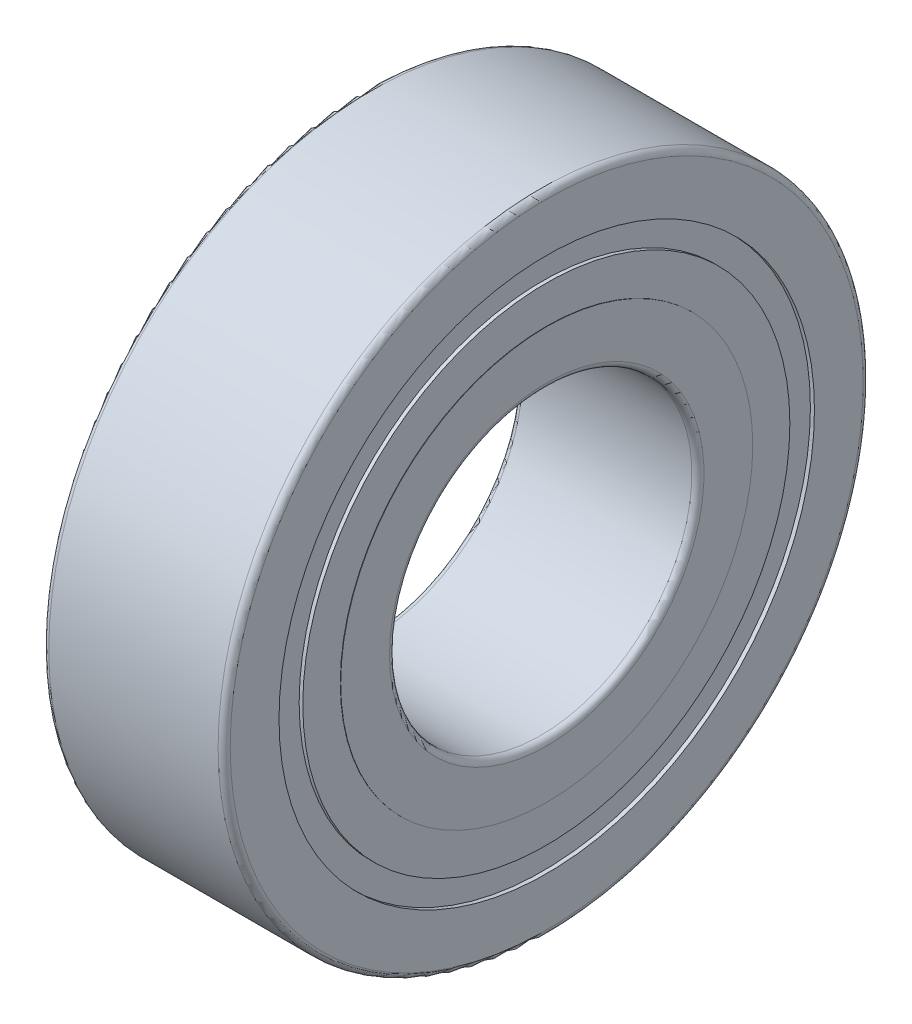
ISO-10303-21;
HEADER;
FILE_DESCRIPTION(('STEP AP214'),'2;1');
FILE_NAME('part.step','',(''),(''),'','','');
FILE_SCHEMA(('AUTOMOTIVE_DESIGN { 1 0 10303 214 1 1 1 1 }'));
ENDSEC;
DATA;
#1=APPLICATION_CONTEXT('core data for automotive mechanical design processes');
#2=APPLICATION_PROTOCOL_DEFINITION('international standard','automotive_design',2000,#1);
#3=PRODUCT_CONTEXT('',#1,'mechanical');
#4=PRODUCT('Part','Part','',(#3));
#5=PRODUCT_RELATED_PRODUCT_CATEGORY('part','',(#4));
#6=PRODUCT_DEFINITION_FORMATION('','',#4);
#7=PRODUCT_DEFINITION_CONTEXT('part definition',#1,'design');
#8=PRODUCT_DEFINITION('design','',#6,#7);
#9=PRODUCT_DEFINITION_SHAPE('','',#8);
#10=(LENGTH_UNIT() NAMED_UNIT(*) SI_UNIT(.MILLI.,.METRE.));
#11=(NAMED_UNIT(*) PLANE_ANGLE_UNIT() SI_UNIT($,.RADIAN.));
#12=(NAMED_UNIT(*) SI_UNIT($,.STERADIAN.) SOLID_ANGLE_UNIT());
#13=UNCERTAINTY_MEASURE_WITH_UNIT(LENGTH_MEASURE(1.E-05),#10,'distance_accuracy_value','');
#14=(GEOMETRIC_REPRESENTATION_CONTEXT(3) GLOBAL_UNCERTAINTY_ASSIGNED_CONTEXT((#13)) GLOBAL_UNIT_ASSIGNED_CONTEXT((#10,
#11,#12)) REPRESENTATION_CONTEXT('',''));
#15=CARTESIAN_POINT('',(0.,0.,0.));
#16=DIRECTION('',(0.,0.,1.));
#17=DIRECTION('',(1.,0.,0.));
#18=AXIS2_PLACEMENT_3D('',#15,#16,#17);
#19=CARTESIAN_POINT('',(4.5,7.8,0.));
#20=DIRECTION('',(-1.,0.,0.));
#21=DIRECTION('',(0.,0.,1.));
#22=AXIS2_PLACEMENT_3D('',#19,#20,#21);
#23=PLANE('',#22);
#24=CARTESIAN_POINT('',(4.5,0.,0.));
#25=DIRECTION('',(-1.,0.,0.));
#26=DIRECTION('',(0.,0.,1.));
#27=AXIS2_PLACEMENT_3D('',#24,#25,#26);
#28=CIRCLE('',#27,15.7);
#29=CARTESIAN_POINT('',(4.5,0.,15.7));
#30=VERTEX_POINT('',#29);
#31=EDGE_CURVE('E69',#30,#30,#28,.T.);
#32=ORIENTED_EDGE('',*,*,#31,.F.);
#33=EDGE_LOOP('',(#32));
#34=FACE_BOUND('',#33,.T.);
#35=CARTESIAN_POINT('',(4.5,0.,0.));
#36=DIRECTION('',(-1.,0.,0.));
#37=DIRECTION('',(0.,0.,1.));
#38=AXIS2_PLACEMENT_3D('',#35,#36,#37);
#39=CIRCLE('',#38,13.28);
#40=CARTESIAN_POINT('',(4.5,0.,13.28));
#41=VERTEX_POINT('',#40);
#42=EDGE_CURVE('E36',#41,#41,#39,.F.);
#43=ORIENTED_EDGE('',*,*,#42,.F.);
#44=EDGE_LOOP('',(#43));
#45=FACE_BOUND('',#44,.T.);
#46=ADVANCED_FACE('F32',(#34,#45),#23,.F.);
#47=CARTESIAN_POINT('',(4.5,0.,0.));
#48=DIRECTION('',(-1.,0.,0.));
#49=DIRECTION('',(0.,0.,1.));
#50=AXIS2_PLACEMENT_3D('',#47,#48,#49);
#51=CIRCLE('',#50,7.8);
#52=CARTESIAN_POINT('',(4.5,0.,7.8));
#53=VERTEX_POINT('',#52);
#54=EDGE_CURVE('E72',#53,#53,#51,.T.);
#55=ORIENTED_EDGE('',*,*,#54,.T.);
#56=EDGE_LOOP('',(#55));
#57=FACE_BOUND('',#56,.T.);
#58=CARTESIAN_POINT('',(4.5,0.,0.));
#59=DIRECTION('',(-1.,0.,0.));
#60=DIRECTION('',(0.,0.,1.));
#61=AXIS2_PLACEMENT_3D('',#58,#59,#60);
#62=CIRCLE('',#61,10.22);
#63=CARTESIAN_POINT('',(4.5,0.,10.22));
#64=VERTEX_POINT('',#63);
#65=EDGE_CURVE('E287',#64,#64,#62,.T.);
#66=ORIENTED_EDGE('',*,*,#65,.F.);
#67=EDGE_LOOP('',(#66));
#68=FACE_BOUND('',#67,.T.);
#69=ADVANCED_FACE('F91',(#57,#68),#23,.F.);
#70=CARTESIAN_POINT('',(-4.5,15.7,0.));
#71=DIRECTION('',(1.,0.,0.));
#72=DIRECTION('',(0.,0.,-1.));
#73=AXIS2_PLACEMENT_3D('',#70,#71,#72);
#74=PLANE('',#73);
#75=CARTESIAN_POINT('',(-4.5,0.,0.));
#76=DIRECTION('',(-1.,0.,0.));
#77=DIRECTION('',(0.,0.,1.));
#78=AXIS2_PLACEMENT_3D('',#75,#76,#77);
#79=CIRCLE('',#78,7.8);
#80=CARTESIAN_POINT('',(-4.5,0.,7.8));
#81=VERTEX_POINT('',#80);
#82=EDGE_CURVE('E40',#81,#81,#79,.T.);
#83=ORIENTED_EDGE('',*,*,#82,.F.);
#84=EDGE_LOOP('',(#83));
#85=FACE_BOUND('',#84,.T.);
#86=CARTESIAN_POINT('',(-4.5,0.,0.));
#87=DIRECTION('',(-1.,0.,0.));
#88=DIRECTION('',(0.,0.,1.));
#89=AXIS2_PLACEMENT_3D('',#86,#87,#88);
#90=CIRCLE('',#89,10.22);
#91=CARTESIAN_POINT('',(-4.5,0.,10.22));
#92=VERTEX_POINT('',#91);
#93=EDGE_CURVE('E51',#92,#92,#90,.T.);
#94=ORIENTED_EDGE('',*,*,#93,.T.);
#95=EDGE_LOOP('',(#94));
#96=FACE_BOUND('',#95,.T.);
#97=ADVANCED_FACE('F88',(#85,#96),#74,.F.);
#98=CARTESIAN_POINT('',(-4.5,0.,0.));
#99=DIRECTION('',(-1.,0.,0.));
#100=DIRECTION('',(0.,0.,1.));
#101=AXIS2_PLACEMENT_3D('',#98,#99,#100);
#102=CIRCLE('',#101,15.7);
#103=CARTESIAN_POINT('',(-4.5,0.,15.7));
#104=VERTEX_POINT('',#103);
#105=EDGE_CURVE('E10',#104,#104,#102,.T.);
#106=ORIENTED_EDGE('',*,*,#105,.T.);
#107=EDGE_LOOP('',(#106));
#108=FACE_BOUND('',#107,.T.);
#109=CARTESIAN_POINT('',(-4.5,0.,0.));
#110=DIRECTION('',(1.,0.,0.));
#111=DIRECTION('',(0.,0.,-1.));
#112=AXIS2_PLACEMENT_3D('',#109,#110,#111);
#113=CIRCLE('',#112,13.28);
#114=CARTESIAN_POINT('',(-4.5,0.,-13.28));
#115=VERTEX_POINT('',#114);
#116=EDGE_CURVE('E48',#115,#115,#113,.F.);
#117=ORIENTED_EDGE('',*,*,#116,.F.);
#118=EDGE_LOOP('',(#117));
#119=FACE_BOUND('',#118,.T.);
#120=ADVANCED_FACE('F90',(#108,#119),#74,.F.);
#121=CARTESIAN_POINT('',(-4.20000000000012,0.,0.));
#122=DIRECTION('',(-1.,0.,0.));
#123=DIRECTION('',(0.,0.,1.));
#124=AXIS2_PLACEMENT_3D('',#121,#122,#123);
#125=TOROIDAL_SURFACE('',#124,15.7000000000001,0.29999999999988);
#126=ORIENTED_EDGE('',*,*,#105,.F.);
#127=EDGE_LOOP('',(#126));
#128=FACE_BOUND('',#127,.T.);
#129=CARTESIAN_POINT('',(-4.2,0.,0.));
#130=DIRECTION('',(-1.,0.,0.));
#131=DIRECTION('',(0.,0.,1.));
#132=AXIS2_PLACEMENT_3D('',#129,#130,#131);
#133=CIRCLE('',#132,16.);
#134=CARTESIAN_POINT('',(-4.2,0.,16.));
#135=VERTEX_POINT('',#134);
#136=EDGE_CURVE('E50',#135,#135,#133,.T.);
#137=ORIENTED_EDGE('',*,*,#136,.T.);
#138=EDGE_LOOP('',(#137));
#139=FACE_BOUND('',#138,.T.);
#140=ADVANCED_FACE('F34',(#128,#139),#125,.T.);
#141=CARTESIAN_POINT('',(-4.20000000000012,0.,0.));
#142=DIRECTION('',(-1.,0.,0.));
#143=DIRECTION('',(0.,0.,1.));
#144=AXIS2_PLACEMENT_3D('',#141,#142,#143);
#145=TOROIDAL_SURFACE('',#144,7.79999999999988,0.299999999999879);
#146=CARTESIAN_POINT('',(-4.2,0.,0.));
#147=DIRECTION('',(-1.,0.,0.));
#148=DIRECTION('',(0.,0.,1.));
#149=AXIS2_PLACEMENT_3D('',#146,#147,#148);
#150=CIRCLE('',#149,7.5);
#151=CARTESIAN_POINT('',(-4.2,0.,7.5));
#152=VERTEX_POINT('',#151);
#153=EDGE_CURVE('E45',#152,#152,#150,.T.);
#154=ORIENTED_EDGE('',*,*,#153,.F.);
#155=EDGE_LOOP('',(#154));
#156=FACE_BOUND('',#155,.T.);
#157=ORIENTED_EDGE('',*,*,#82,.T.);
#158=EDGE_LOOP('',(#157));
#159=FACE_BOUND('',#158,.T.);
#160=ADVANCED_FACE('F82',(#156,#159),#145,.T.);
#161=CARTESIAN_POINT('',(50.,0.,0.));
#162=DIRECTION('',(-1.,0.,0.));
#163=DIRECTION('',(0.,0.,1.));
#164=AXIS2_PLACEMENT_3D('',#161,#162,#163);
#165=CYLINDRICAL_SURFACE('',#164,7.5);
#166=CARTESIAN_POINT('',(4.2,0.,0.));
#167=DIRECTION('',(-1.,0.,0.));
#168=DIRECTION('',(0.,0.,1.));
#169=AXIS2_PLACEMENT_3D('',#166,#167,#168);
#170=CIRCLE('',#169,7.5);
#171=CARTESIAN_POINT('',(4.2,0.,7.5));
#172=VERTEX_POINT('',#171);
#173=EDGE_CURVE('E75',#172,#172,#170,.T.);
#174=ORIENTED_EDGE('',*,*,#173,.F.);
#175=EDGE_LOOP('',(#174));
#176=FACE_BOUND('',#175,.T.);
#177=ORIENTED_EDGE('',*,*,#153,.T.);
#178=EDGE_LOOP('',(#177));
#179=FACE_BOUND('',#178,.T.);
#180=ADVANCED_FACE('F80',(#176,#179),#165,.F.);
#181=CARTESIAN_POINT('',(4.20000000000012,0.,0.));
#182=DIRECTION('',(-1.,0.,0.));
#183=DIRECTION('',(0.,0.,1.));
#184=AXIS2_PLACEMENT_3D('',#181,#182,#183);
#185=TOROIDAL_SURFACE('',#184,7.79999999999988,0.299999999999879);
#186=ORIENTED_EDGE('',*,*,#54,.F.);
#187=EDGE_LOOP('',(#186));
#188=FACE_BOUND('',#187,.T.);
#189=ORIENTED_EDGE('',*,*,#173,.T.);
#190=EDGE_LOOP('',(#189));
#191=FACE_BOUND('',#190,.T.);
#192=ADVANCED_FACE('F108',(#188,#191),#185,.T.);
#193=CARTESIAN_POINT('',(4.20000000000012,0.,0.));
#194=DIRECTION('',(-1.,0.,0.));
#195=DIRECTION('',(0.,0.,1.));
#196=AXIS2_PLACEMENT_3D('',#193,#194,#195);
#197=TOROIDAL_SURFACE('',#196,15.7000000000001,0.29999999999988);
#198=CARTESIAN_POINT('',(4.2,0.,0.));
#199=DIRECTION('',(-1.,0.,0.));
#200=DIRECTION('',(0.,0.,1.));
#201=AXIS2_PLACEMENT_3D('',#198,#199,#200);
#202=CIRCLE('',#201,16.);
#203=CARTESIAN_POINT('',(4.2,0.,16.));
#204=VERTEX_POINT('',#203);
#205=EDGE_CURVE('E55',#204,#204,#202,.T.);
#206=ORIENTED_EDGE('',*,*,#205,.F.);
#207=EDGE_LOOP('',(#206));
#208=FACE_BOUND('',#207,.T.);
#209=ORIENTED_EDGE('',*,*,#31,.T.);
#210=EDGE_LOOP('',(#209));
#211=FACE_BOUND('',#210,.T.);
#212=ADVANCED_FACE('F106',(#208,#211),#197,.T.);
#213=CARTESIAN_POINT('',(50.,0.,0.));
#214=DIRECTION('',(-1.,0.,0.));
#215=DIRECTION('',(0.,0.,1.));
#216=AXIS2_PLACEMENT_3D('',#213,#214,#215);
#217=CYLINDRICAL_SURFACE('',#216,16.);
#218=ORIENTED_EDGE('',*,*,#136,.F.);
#219=EDGE_LOOP('',(#218));
#220=FACE_BOUND('',#219,.T.);
#221=ORIENTED_EDGE('',*,*,#205,.T.);
#222=EDGE_LOOP('',(#221));
#223=FACE_BOUND('',#222,.T.);
#224=ADVANCED_FACE('F131',(#220,#223),#217,.T.);
#225=CARTESIAN_POINT('',(50.,0.,0.));
#226=DIRECTION('',(-1.,0.,0.));
#227=DIRECTION('',(0.,0.,1.));
#228=AXIS2_PLACEMENT_3D('',#225,#226,#227);
#229=CYLINDRICAL_SURFACE('',#228,13.28);
#230=CARTESIAN_POINT('',(-4.3,0.,0.));
#231=DIRECTION('',(-1.,0.,0.));
#232=DIRECTION('',(0.,0.,1.));
#233=AXIS2_PLACEMENT_3D('',#230,#231,#232);
#234=CIRCLE('',#233,13.28);
#235=CARTESIAN_POINT('',(-4.3,0.,13.28));
#236=VERTEX_POINT('',#235);
#237=EDGE_CURVE('E303',#236,#236,#234,.T.);
#238=ORIENTED_EDGE('',*,*,#237,.F.);
#239=EDGE_LOOP('',(#238));
#240=FACE_BOUND('',#239,.T.);
#241=ORIENTED_EDGE('',*,*,#116,.T.);
#242=EDGE_LOOP('',(#241));
#243=FACE_BOUND('',#242,.T.);
#244=ADVANCED_FACE('F138',(#240,#243),#229,.F.);
#245=CARTESIAN_POINT('',(50.,0.,0.));
#246=DIRECTION('',(-1.,0.,0.));
#247=DIRECTION('',(0.,0.,1.));
#248=AXIS2_PLACEMENT_3D('',#245,#246,#247);
#249=CYLINDRICAL_SURFACE('',#248,10.22);
#250=CARTESIAN_POINT('',(-4.48,0.,0.));
#251=DIRECTION('',(-1.,0.,0.));
#252=DIRECTION('',(0.,0.,1.));
#253=AXIS2_PLACEMENT_3D('',#250,#251,#252);
#254=CIRCLE('',#253,10.22);
#255=CARTESIAN_POINT('',(-4.48,0.,10.22));
#256=VERTEX_POINT('',#255);
#257=EDGE_CURVE('E58',#256,#256,#254,.T.);
#258=ORIENTED_EDGE('',*,*,#257,.T.);
#259=EDGE_LOOP('',(#258));
#260=FACE_BOUND('',#259,.T.);
#261=ORIENTED_EDGE('',*,*,#93,.F.);
#262=EDGE_LOOP('',(#261));
#263=FACE_BOUND('',#262,.T.);
#264=ADVANCED_FACE('F145',(#260,#263),#249,.T.);
#265=CARTESIAN_POINT('',(-4.48,10.22,0.));
#266=DIRECTION('',(-1.,0.,0.));
#267=DIRECTION('',(0.,0.,1.));
#268=AXIS2_PLACEMENT_3D('',#265,#266,#267);
#269=PLANE('',#268);
#270=CARTESIAN_POINT('',(-4.48,0.,0.));
#271=DIRECTION('',(-1.,0.,0.));
#272=DIRECTION('',(0.,0.,1.));
#273=AXIS2_PLACEMENT_3D('',#270,#271,#272);
#274=CIRCLE('',#273,12.08);
#275=CARTESIAN_POINT('',(-4.48,0.,12.08));
#276=VERTEX_POINT('',#275);
#277=EDGE_CURVE('E63',#276,#276,#274,.T.);
#278=ORIENTED_EDGE('',*,*,#277,.T.);
#279=EDGE_LOOP('',(#278));
#280=FACE_BOUND('',#279,.T.);
#281=ORIENTED_EDGE('',*,*,#257,.F.);
#282=EDGE_LOOP('',(#281));
#283=FACE_BOUND('',#282,.T.);
#284=ADVANCED_FACE('F154',(#280,#283),#269,.T.);
#285=CARTESIAN_POINT('',(50.,0.,0.));
#286=DIRECTION('',(-1.,0.,0.));
#287=DIRECTION('',(0.,0.,1.));
#288=AXIS2_PLACEMENT_3D('',#285,#286,#287);
#289=CYLINDRICAL_SURFACE('',#288,12.08);
#290=CARTESIAN_POINT('',(-4.3,0.,0.));
#291=DIRECTION('',(-1.,0.,0.));
#292=DIRECTION('',(0.,0.,1.));
#293=AXIS2_PLACEMENT_3D('',#290,#291,#292);
#294=CIRCLE('',#293,12.08);
#295=CARTESIAN_POINT('',(-4.3,0.,12.08));
#296=VERTEX_POINT('',#295);
#297=EDGE_CURVE('E306',#296,#296,#294,.T.);
#298=ORIENTED_EDGE('',*,*,#297,.T.);
#299=EDGE_LOOP('',(#298));
#300=FACE_BOUND('',#299,.T.);
#301=ORIENTED_EDGE('',*,*,#277,.F.);
#302=EDGE_LOOP('',(#301));
#303=FACE_BOUND('',#302,.T.);
#304=ADVANCED_FACE('F162',(#300,#303),#289,.T.);
#305=CARTESIAN_POINT('',(-4.3,12.08,0.));
#306=DIRECTION('',(-1.,0.,0.));
#307=DIRECTION('',(0.,0.,1.));
#308=AXIS2_PLACEMENT_3D('',#305,#306,#307);
#309=PLANE('',#308);
#310=ORIENTED_EDGE('',*,*,#237,.T.);
#311=EDGE_LOOP('',(#310));
#312=FACE_BOUND('',#311,.T.);
#313=ORIENTED_EDGE('',*,*,#297,.F.);
#314=EDGE_LOOP('',(#313));
#315=FACE_BOUND('',#314,.T.);
#316=ADVANCED_FACE('F170',(#312,#315),#309,.T.);
#317=CARTESIAN_POINT('',(50.,0.,0.));
#318=DIRECTION('',(-1.,0.,0.));
#319=DIRECTION('',(0.,0.,1.));
#320=AXIS2_PLACEMENT_3D('',#317,#318,#319);
#321=CYLINDRICAL_SURFACE('',#320,13.28);
#322=CARTESIAN_POINT('',(4.3,0.,0.));
#323=DIRECTION('',(-1.,0.,0.));
#324=DIRECTION('',(0.,0.,1.));
#325=AXIS2_PLACEMENT_3D('',#322,#323,#324);
#326=CIRCLE('',#325,13.28);
#327=CARTESIAN_POINT('',(4.3,0.,13.28));
#328=VERTEX_POINT('',#327);
#329=EDGE_CURVE('E300',#328,#328,#326,.T.);
#330=ORIENTED_EDGE('',*,*,#329,.T.);
#331=EDGE_LOOP('',(#330));
#332=FACE_BOUND('',#331,.T.);
#333=ORIENTED_EDGE('',*,*,#42,.T.);
#334=EDGE_LOOP('',(#333));
#335=FACE_BOUND('',#334,.T.);
#336=ADVANCED_FACE('F178',(#332,#335),#321,.F.);
#337=CARTESIAN_POINT('',(4.3,13.28,0.));
#338=DIRECTION('',(1.,0.,0.));
#339=DIRECTION('',(0.,0.,-1.));
#340=AXIS2_PLACEMENT_3D('',#337,#338,#339);
#341=PLANE('',#340);
#342=CARTESIAN_POINT('',(4.3,0.,0.));
#343=DIRECTION('',(-1.,0.,0.));
#344=DIRECTION('',(0.,0.,1.));
#345=AXIS2_PLACEMENT_3D('',#342,#343,#344);
#346=CIRCLE('',#345,12.08);
#347=CARTESIAN_POINT('',(4.3,0.,12.08));
#348=VERTEX_POINT('',#347);
#349=EDGE_CURVE('E294',#348,#348,#346,.T.);
#350=ORIENTED_EDGE('',*,*,#349,.T.);
#351=EDGE_LOOP('',(#350));
#352=FACE_BOUND('',#351,.T.);
#353=ORIENTED_EDGE('',*,*,#329,.F.);
#354=EDGE_LOOP('',(#353));
#355=FACE_BOUND('',#354,.T.);
#356=ADVANCED_FACE('F186',(#352,#355),#341,.T.);
#357=CARTESIAN_POINT('',(50.,0.,0.));
#358=DIRECTION('',(-1.,0.,0.));
#359=DIRECTION('',(0.,0.,1.));
#360=AXIS2_PLACEMENT_3D('',#357,#358,#359);
#361=CYLINDRICAL_SURFACE('',#360,12.08);
#362=CARTESIAN_POINT('',(4.48,0.,0.));
#363=DIRECTION('',(-1.,0.,0.));
#364=DIRECTION('',(0.,0.,1.));
#365=AXIS2_PLACEMENT_3D('',#362,#363,#364);
#366=CIRCLE('',#365,12.08);
#367=CARTESIAN_POINT('',(4.48,0.,12.08));
#368=VERTEX_POINT('',#367);
#369=EDGE_CURVE('E291',#368,#368,#366,.T.);
#370=ORIENTED_EDGE('',*,*,#369,.T.);
#371=EDGE_LOOP('',(#370));
#372=FACE_BOUND('',#371,.T.);
#373=ORIENTED_EDGE('',*,*,#349,.F.);
#374=EDGE_LOOP('',(#373));
#375=FACE_BOUND('',#374,.T.);
#376=ADVANCED_FACE('F195',(#372,#375),#361,.T.);
#377=CARTESIAN_POINT('',(4.48,12.08,0.));
#378=DIRECTION('',(1.,0.,0.));
#379=DIRECTION('',(0.,0.,-1.));
#380=AXIS2_PLACEMENT_3D('',#377,#378,#379);
#381=PLANE('',#380);
#382=CARTESIAN_POINT('',(4.48,0.,0.));
#383=DIRECTION('',(-1.,0.,0.));
#384=DIRECTION('',(0.,0.,1.));
#385=AXIS2_PLACEMENT_3D('',#382,#383,#384);
#386=CIRCLE('',#385,10.22);
#387=CARTESIAN_POINT('',(4.48,0.,10.22));
#388=VERTEX_POINT('',#387);
#389=EDGE_CURVE('E290',#388,#388,#386,.T.);
#390=ORIENTED_EDGE('',*,*,#389,.T.);
#391=EDGE_LOOP('',(#390));
#392=FACE_BOUND('',#391,.T.);
#393=ORIENTED_EDGE('',*,*,#369,.F.);
#394=EDGE_LOOP('',(#393));
#395=FACE_BOUND('',#394,.T.);
#396=ADVANCED_FACE('F203',(#392,#395),#381,.T.);
#397=CARTESIAN_POINT('',(50.,0.,0.));
#398=DIRECTION('',(-1.,0.,0.));
#399=DIRECTION('',(0.,0.,1.));
#400=AXIS2_PLACEMENT_3D('',#397,#398,#399);
#401=CYLINDRICAL_SURFACE('',#400,10.22);
#402=ORIENTED_EDGE('',*,*,#65,.T.);
#403=EDGE_LOOP('',(#402));
#404=FACE_BOUND('',#403,.T.);
#405=ORIENTED_EDGE('',*,*,#389,.F.);
#406=EDGE_LOOP('',(#405));
#407=FACE_BOUND('',#406,.T.);
#408=ADVANCED_FACE('F211',(#404,#407),#401,.T.);
#409=CLOSED_SHELL('',(#46,#69,#97,#120,#140,#160,#180,#192,#212,#224,#244,#264,#284,#304,#316,
#336,#356,#376,#396,#408));
#410=MANIFOLD_SOLID_BREP('B2',#409);
#411=ADVANCED_BREP_SHAPE_REPRESENTATION('',(#18,#410),#14);
#412=SHAPE_DEFINITION_REPRESENTATION(#9,#411);
ENDSEC;
END-ISO-10303-21;
